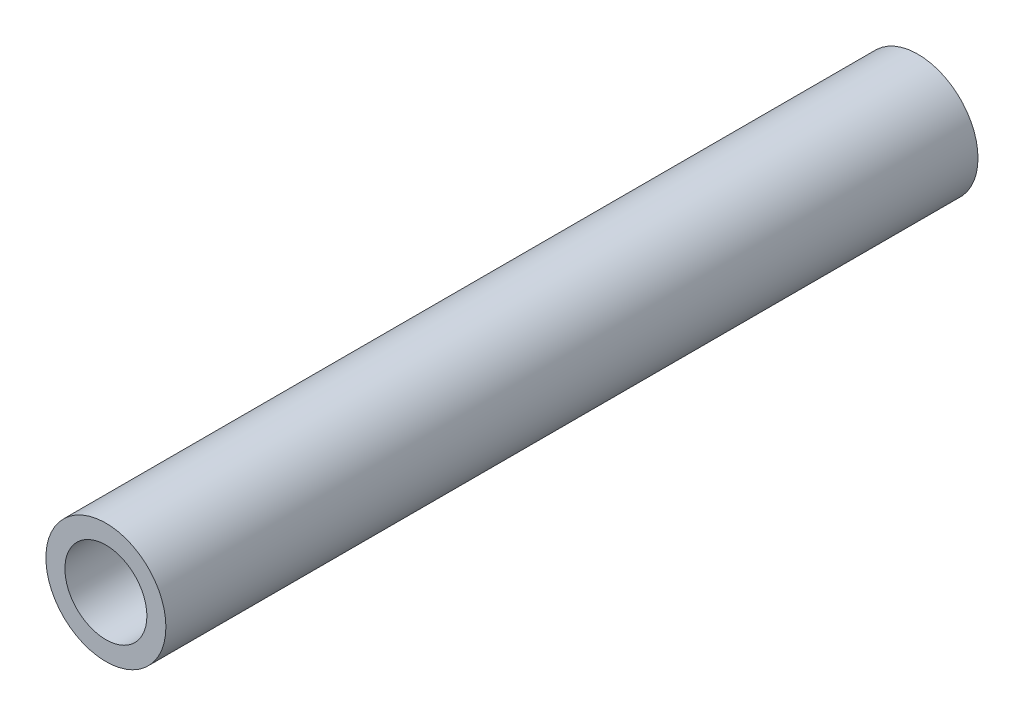
ISO-10303-21;
HEADER;
FILE_DESCRIPTION(('STEP AP214'),'2;1');
FILE_NAME('part.step','',(''),(''),'','','');
FILE_SCHEMA(('AUTOMOTIVE_DESIGN { 1 0 10303 214 1 1 1 1 }'));
ENDSEC;
DATA;
#1=APPLICATION_CONTEXT('core data for automotive mechanical design processes');
#2=APPLICATION_PROTOCOL_DEFINITION('international standard','automotive_design',2000,#1);
#3=PRODUCT_CONTEXT('',#1,'mechanical');
#4=PRODUCT('Part','Part','',(#3));
#5=PRODUCT_RELATED_PRODUCT_CATEGORY('part','',(#4));
#6=PRODUCT_DEFINITION_FORMATION('','',#4);
#7=PRODUCT_DEFINITION_CONTEXT('part definition',#1,'design');
#8=PRODUCT_DEFINITION('design','',#6,#7);
#9=PRODUCT_DEFINITION_SHAPE('','',#8);
#10=(LENGTH_UNIT() NAMED_UNIT(*) SI_UNIT(.MILLI.,.METRE.));
#11=(NAMED_UNIT(*) PLANE_ANGLE_UNIT() SI_UNIT($,.RADIAN.));
#12=(NAMED_UNIT(*) SI_UNIT($,.STERADIAN.) SOLID_ANGLE_UNIT());
#13=UNCERTAINTY_MEASURE_WITH_UNIT(LENGTH_MEASURE(1.E-05),#10,'distance_accuracy_value','');
#14=(GEOMETRIC_REPRESENTATION_CONTEXT(3) GLOBAL_UNCERTAINTY_ASSIGNED_CONTEXT((#13)) GLOBAL_UNIT_ASSIGNED_CONTEXT((#10,
#11,#12)) REPRESENTATION_CONTEXT('',''));
#15=CARTESIAN_POINT('',(0.,0.,0.));
#16=DIRECTION('',(0.,0.,1.));
#17=DIRECTION('',(1.,0.,0.));
#18=AXIS2_PLACEMENT_3D('',#15,#16,#17);
#19=CARTESIAN_POINT('',(0.,0.,81.2));
#20=DIRECTION('',(0.,0.,1.));
#21=DIRECTION('',(1.,0.,0.));
#22=AXIS2_PLACEMENT_3D('',#19,#20,#21);
#23=PLANE('',#22);
#24=CARTESIAN_POINT('',(0.,0.,81.2));
#25=DIRECTION('',(0.,0.,1.));
#26=DIRECTION('',(1.,0.,0.));
#27=AXIS2_PLACEMENT_3D('',#24,#25,#26);
#28=CIRCLE('',#27,6.);
#29=CARTESIAN_POINT('',(6.,0.,81.2));
#30=VERTEX_POINT('',#29);
#31=EDGE_CURVE('E12',#30,#30,#28,.T.);
#32=ORIENTED_EDGE('',*,*,#31,.T.);
#33=EDGE_LOOP('',(#32));
#34=FACE_BOUND('',#33,.T.);
#35=CARTESIAN_POINT('',(0.,0.,81.2));
#36=DIRECTION('',(0.,0.,1.));
#37=DIRECTION('',(1.,0.,0.));
#38=AXIS2_PLACEMENT_3D('',#35,#36,#37);
#39=CIRCLE('',#38,4.1);
#40=CARTESIAN_POINT('',(4.1,0.,81.2));
#41=VERTEX_POINT('',#40);
#42=EDGE_CURVE('E59',#41,#41,#39,.T.);
#43=ORIENTED_EDGE('',*,*,#42,.F.);
#44=EDGE_LOOP('',(#43));
#45=FACE_BOUND('',#44,.T.);
#46=ADVANCED_FACE('F46',(#34,#45),#23,.T.);
#47=CARTESIAN_POINT('',(0.,0.,0.));
#48=DIRECTION('',(0.,0.,1.));
#49=DIRECTION('',(1.,0.,0.));
#50=AXIS2_PLACEMENT_3D('',#47,#48,#49);
#51=PLANE('',#50);
#52=CARTESIAN_POINT('',(0.,0.,0.));
#53=DIRECTION('',(0.,0.,1.));
#54=DIRECTION('',(1.,0.,0.));
#55=AXIS2_PLACEMENT_3D('',#52,#53,#54);
#56=CIRCLE('',#55,6.);
#57=CARTESIAN_POINT('',(6.,0.,0.));
#58=VERTEX_POINT('',#57);
#59=EDGE_CURVE('E50',#58,#58,#56,.T.);
#60=ORIENTED_EDGE('',*,*,#59,.F.);
#61=EDGE_LOOP('',(#60));
#62=FACE_BOUND('',#61,.T.);
#63=CARTESIAN_POINT('',(0.,0.,0.));
#64=DIRECTION('',(0.,0.,1.));
#65=DIRECTION('',(1.,0.,0.));
#66=AXIS2_PLACEMENT_3D('',#63,#64,#65);
#67=CIRCLE('',#66,4.1);
#68=CARTESIAN_POINT('',(4.1,0.,0.));
#69=VERTEX_POINT('',#68);
#70=EDGE_CURVE('E61',#69,#69,#67,.T.);
#71=ORIENTED_EDGE('',*,*,#70,.T.);
#72=EDGE_LOOP('',(#71));
#73=FACE_BOUND('',#72,.T.);
#74=ADVANCED_FACE('F73',(#62,#73),#51,.F.);
#75=CARTESIAN_POINT('',(0.,0.,81.2));
#76=DIRECTION('',(0.,0.,-1.));
#77=DIRECTION('',(-1.,0.,0.));
#78=AXIS2_PLACEMENT_3D('',#75,#76,#77);
#79=CYLINDRICAL_SURFACE('',#78,6.);
#80=ORIENTED_EDGE('',*,*,#31,.F.);
#81=EDGE_LOOP('',(#80));
#82=FACE_BOUND('',#81,.T.);
#83=ORIENTED_EDGE('',*,*,#59,.T.);
#84=EDGE_LOOP('',(#83));
#85=FACE_BOUND('',#84,.T.);
#86=ADVANCED_FACE('F48',(#82,#85),#79,.T.);
#87=CARTESIAN_POINT('',(0.,0.,81.2));
#88=DIRECTION('',(0.,0.,-1.));
#89=DIRECTION('',(-1.,0.,0.));
#90=AXIS2_PLACEMENT_3D('',#87,#88,#89);
#91=CYLINDRICAL_SURFACE('',#90,4.1);
#92=ORIENTED_EDGE('',*,*,#42,.T.);
#93=EDGE_LOOP('',(#92));
#94=FACE_BOUND('',#93,.T.);
#95=ORIENTED_EDGE('',*,*,#70,.F.);
#96=EDGE_LOOP('',(#95));
#97=FACE_BOUND('',#96,.T.);
#98=ADVANCED_FACE('F69',(#94,#97),#91,.F.);
#99=CLOSED_SHELL('',(#46,#74,#86,#98));
#100=MANIFOLD_SOLID_BREP('B2',#99);
#101=ADVANCED_BREP_SHAPE_REPRESENTATION('',(#18,#100),#14);
#102=SHAPE_DEFINITION_REPRESENTATION(#9,#101);
ENDSEC;
END-ISO-10303-21;
